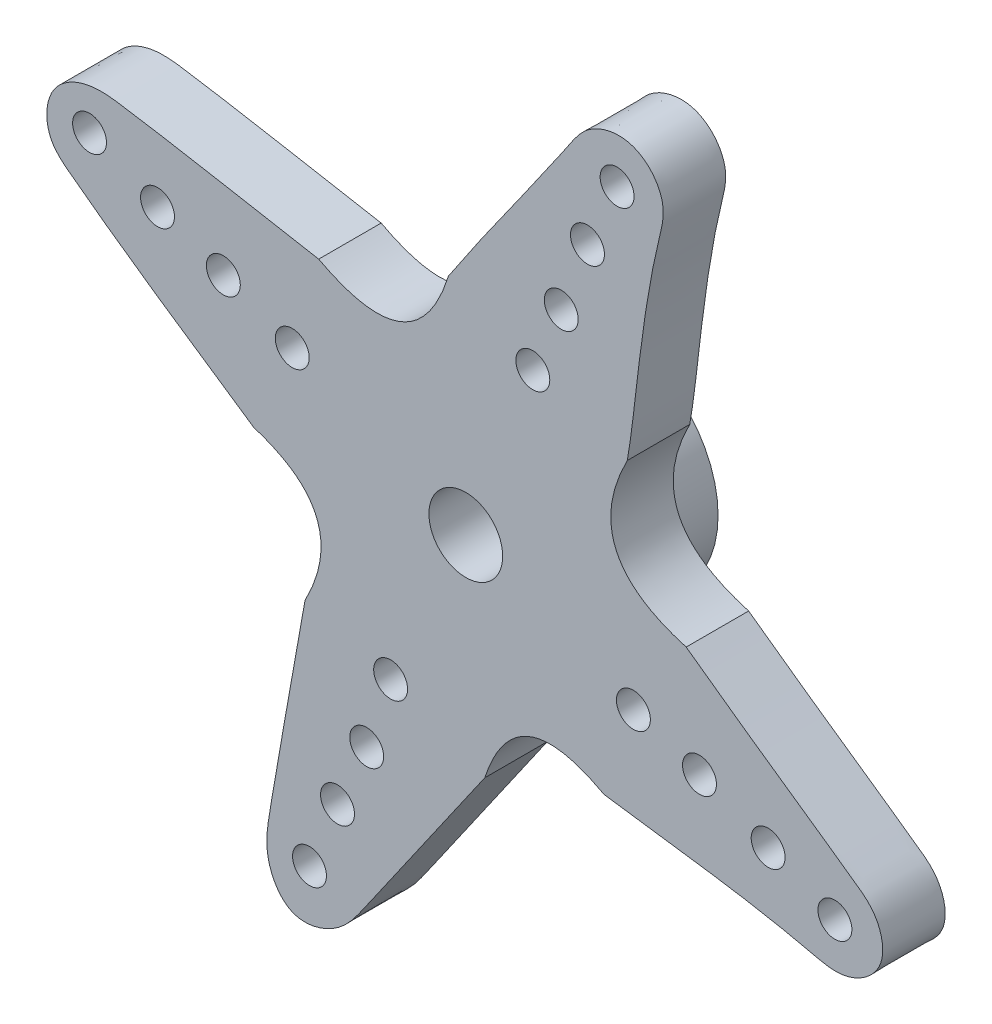
ISO-10303-21;
HEADER;
FILE_DESCRIPTION(('STEP AP214'),'2;1');
FILE_NAME('part.step','',(''),(''),'','','');
FILE_SCHEMA(('AUTOMOTIVE_DESIGN { 1 0 10303 214 1 1 1 1 }'));
ENDSEC;
DATA;
#1=APPLICATION_CONTEXT('core data for automotive mechanical design processes');
#2=APPLICATION_PROTOCOL_DEFINITION('international standard','automotive_design',2000,#1);
#3=PRODUCT_CONTEXT('',#1,'mechanical');
#4=PRODUCT('Part','Part','',(#3));
#5=PRODUCT_RELATED_PRODUCT_CATEGORY('part','',(#4));
#6=PRODUCT_DEFINITION_FORMATION('','',#4);
#7=PRODUCT_DEFINITION_CONTEXT('part definition',#1,'design');
#8=PRODUCT_DEFINITION('design','',#6,#7);
#9=PRODUCT_DEFINITION_SHAPE('','',#8);
#10=(LENGTH_UNIT() NAMED_UNIT(*) SI_UNIT(.MILLI.,.METRE.));
#11=(NAMED_UNIT(*) PLANE_ANGLE_UNIT() SI_UNIT($,.RADIAN.));
#12=(NAMED_UNIT(*) SI_UNIT($,.STERADIAN.) SOLID_ANGLE_UNIT());
#13=UNCERTAINTY_MEASURE_WITH_UNIT(LENGTH_MEASURE(1.E-05),#10,'distance_accuracy_value','');
#14=(GEOMETRIC_REPRESENTATION_CONTEXT(3) GLOBAL_UNCERTAINTY_ASSIGNED_CONTEXT((#13)) GLOBAL_UNIT_ASSIGNED_CONTEXT((#10,
#11,#12)) REPRESENTATION_CONTEXT('',''));
#15=CARTESIAN_POINT('',(0.,0.,0.));
#16=DIRECTION('',(0.,0.,1.));
#17=DIRECTION('',(1.,0.,0.));
#18=AXIS2_PLACEMENT_3D('',#15,#16,#17);
#19=CARTESIAN_POINT('',(6.82853944152075,17.0743412386927,2.54));
#20=DIRECTION('',(0.,0.,1.));
#21=DIRECTION('',(1.,0.,0.));
#22=AXIS2_PLACEMENT_3D('',#19,#20,#21);
#23=PLANE('',#22);
#24=CARTESIAN_POINT('',(15.0110323014964,-6.04474796311474,2.54));
#25=DIRECTION('',(0.,0.,1.));
#26=DIRECTION('',(1.,0.,0.));
#27=AXIS2_PLACEMENT_3D('',#24,#25,#26);
#28=CIRCLE('',#27,0.689564765000003);
#29=CARTESIAN_POINT('',(15.7005970664964,-6.04474796311474,2.54));
#30=VERTEX_POINT('',#29);
#31=EDGE_CURVE('E1509',#30,#30,#28,.T.);
#32=ORIENTED_EDGE('',*,*,#31,.F.);
#33=EDGE_LOOP('',(#32));
#34=FACE_BOUND('',#33,.T.);
#35=CARTESIAN_POINT('',(9.50380695056552,-3.69400279681072,2.54));
#36=DIRECTION('',(0.,0.,1.));
#37=DIRECTION('',(1.,0.,0.));
#38=AXIS2_PLACEMENT_3D('',#35,#36,#37);
#39=CIRCLE('',#38,0.689564765000001);
#40=CARTESIAN_POINT('',(10.1933717155655,-3.69400279681072,2.54));
#41=VERTEX_POINT('',#40);
#42=EDGE_CURVE('E1522',#41,#41,#39,.T.);
#43=ORIENTED_EDGE('',*,*,#42,.F.);
#44=EDGE_LOOP('',(#43));
#45=FACE_BOUND('',#44,.T.);
#46=CARTESIAN_POINT('',(6.15355173549287,15.3431479204628,2.54));
#47=DIRECTION('',(0.,0.,1.));
#48=DIRECTION('',(1.,0.,0.));
#49=AXIS2_PLACEMENT_3D('',#46,#47,#48);
#50=CIRCLE('',#49,0.689564764999999);
#51=CARTESIAN_POINT('',(6.84311650049287,15.3431479204628,2.54));
#52=VERTEX_POINT('',#51);
#53=EDGE_CURVE('E1530',#52,#52,#50,.T.);
#54=ORIENTED_EDGE('',*,*,#53,.F.);
#55=EDGE_LOOP('',(#54));
#56=FACE_BOUND('',#55,.T.);
#57=CARTESIAN_POINT('',(3.88207996758738,9.87307305081287,2.54));
#58=DIRECTION('',(0.,0.,1.));
#59=DIRECTION('',(1.,0.,0.));
#60=AXIS2_PLACEMENT_3D('',#57,#58,#59);
#61=CIRCLE('',#60,0.689564764999999);
#62=CARTESIAN_POINT('',(4.57164473258738,9.87307305081287,2.54));
#63=VERTEX_POINT('',#62);
#64=EDGE_CURVE('E1538',#63,#63,#61,.T.);
#65=ORIENTED_EDGE('',*,*,#64,.F.);
#66=EDGE_LOOP('',(#65));
#67=FACE_BOUND('',#66,.T.);
#68=CARTESIAN_POINT('',(-15.299960499322,6.51066111786951,2.54));
#69=DIRECTION('',(0.,0.,1.));
#70=DIRECTION('',(1.,0.,0.));
#71=AXIS2_PLACEMENT_3D('',#68,#69,#70);
#72=CIRCLE('',#71,0.689564765000001);
#73=CARTESIAN_POINT('',(-14.610395734322,6.51066111786951,2.54));
#74=VERTEX_POINT('',#73);
#75=EDGE_CURVE('E1546',#74,#74,#72,.T.);
#76=ORIENTED_EDGE('',*,*,#75,.F.);
#77=EDGE_LOOP('',(#76));
#78=FACE_BOUND('',#77,.T.);
#79=CARTESIAN_POINT('',(-9.85922555833631,4.21630227451655,2.54));
#80=DIRECTION('',(0.,0.,1.));
#81=DIRECTION('',(1.,0.,0.));
#82=AXIS2_PLACEMENT_3D('',#79,#80,#81);
#83=CIRCLE('',#82,0.689564765000001);
#84=CARTESIAN_POINT('',(-9.16966079333631,4.21630227451655,2.54));
#85=VERTEX_POINT('',#84);
#86=EDGE_CURVE('E1554',#85,#85,#83,.T.);
#87=ORIENTED_EDGE('',*,*,#86,.F.);
#88=EDGE_LOOP('',(#87));
#89=FACE_BOUND('',#88,.T.);
#90=CARTESIAN_POINT('',(-6.35515129323099,-14.8372029157483,2.54));
#91=DIRECTION('',(0.,0.,1.));
#92=DIRECTION('',(1.,0.,0.));
#93=AXIS2_PLACEMENT_3D('',#90,#91,#92);
#94=CIRCLE('',#93,0.689564764999999);
#95=CARTESIAN_POINT('',(-5.66558652823099,-14.8372029157483,2.54));
#96=VERTEX_POINT('',#95);
#97=EDGE_CURVE('E1562',#96,#96,#94,.T.);
#98=ORIENTED_EDGE('',*,*,#97,.F.);
#99=EDGE_LOOP('',(#98));
#100=FACE_BOUND('',#99,.T.);
#101=CARTESIAN_POINT('',(-4.02933004456876,-9.48240515720032,2.54));
#102=DIRECTION('',(0.,0.,1.));
#103=DIRECTION('',(1.,0.,0.));
#104=AXIS2_PLACEMENT_3D('',#101,#102,#103);
#105=CIRCLE('',#104,0.689564765);
#106=CARTESIAN_POINT('',(-3.33976527956876,-9.48240515720032,2.54));
#107=VERTEX_POINT('',#106);
#108=EDGE_CURVE('E1570',#107,#107,#105,.T.);
#109=ORIENTED_EDGE('',*,*,#108,.F.);
#110=EDGE_LOOP('',(#109));
#111=FACE_BOUND('',#110,.T.);
#112=CARTESIAN_POINT('',(-0.703210077517724,8.76805022749938,2.54));
#113=CARTESIAN_POINT('',(1.0381039908637,11.4145666756958,2.54));
#114=CARTESIAN_POINT('',(2.72632780891961,13.6001825715562,2.54));
#115=CARTESIAN_POINT('',(4.9857595076741,17.02869940722,2.54));
#116=CARTESIAN_POINT('',(6.94499629770619,17.4757430128905,2.54));
#117=CARTESIAN_POINT('',(8.24923979238083,15.8420364505879,2.54));
#118=CARTESIAN_POINT('',(7.12374128944502,11.6665294451666,2.54));
#119=CARTESIAN_POINT('',(6.91279609115673,7.79561059767481,2.54));
#120=CARTESIAN_POINT('',(6.56712149500294,5.90543390832021,2.54));
#121=B_SPLINE_CURVE_WITH_KNOTS('',3,(#112,#113,#114,#115,#116,#117,#118,#119,#120),
.UNSPECIFIED.,.F.,.F.,(4,1,1,1,1,1,4),(0.,0.368171065262444,0.418118471817799,0.499474065553551,
0.581227244319548,0.631279837764193,1.),.UNSPECIFIED.);
#122=CARTESIAN_POINT('',(-0.703210077517724,8.76805022749938,2.54));
#123=VERTEX_POINT('',#122);
#124=CARTESIAN_POINT('',(6.56712149500294,5.90543390832021,2.54));
#125=VERTEX_POINT('',#124);
#126=EDGE_CURVE('E1330',#123,#125,#121,.T.);
#127=ORIENTED_EDGE('',*,*,#126,.F.);
#128=CARTESIAN_POINT('',(-0.703210077517724,8.76805022749938,2.54));
#129=CARTESIAN_POINT('',(-2.00862770502038,4.60560126571447,2.54));
#130=CARTESIAN_POINT('',(-5.98058844150273,6.72376397762608,2.54));
#131=B_SPLINE_CURVE_WITH_KNOTS('',2,(#128,#129,#130),.UNSPECIFIED.,.F.,.F.,(3,3),(0.,1.),.UNSPECIFIED.);
#132=CARTESIAN_POINT('',(-5.98058844150273,6.72376397762608,2.54));
#133=VERTEX_POINT('',#132);
#134=EDGE_CURVE('E1274',#123,#133,#131,.T.);
#135=ORIENTED_EDGE('',*,*,#134,.T.);
#136=CARTESIAN_POINT('',(-8.62512041047836,-0.523225883449996,2.54));
#137=CARTESIAN_POINT('',(-12.0915100625833,1.82548059142509,2.54));
#138=CARTESIAN_POINT('',(-13.6556544540435,2.85197258646134,2.54));
#139=CARTESIAN_POINT('',(-17.1250188284723,5.4628982619902,2.54));
#140=CARTESIAN_POINT('',(-17.0830031073306,7.51790593543252,2.54));
#141=CARTESIAN_POINT('',(-15.3867381584555,8.3519591654845,2.54));
#142=CARTESIAN_POINT('',(-11.0921197480101,7.67928259894828,2.54));
#143=CARTESIAN_POINT('',(-8.69928178717215,7.19505935389887,2.54));
#144=CARTESIAN_POINT('',(-5.98058844150273,6.72376397762608,2.54));
#145=B_SPLINE_CURVE_WITH_KNOTS('',3,(#136,#137,#138,#139,#140,#141,#142,#143,#144),
.UNSPECIFIED.,.F.,.F.,(4,1,1,1,1,1,4),(0.,0.388587578903851,0.43995621972371,0.51368640819859,
0.605056424474045,0.653687783654186,1.),.UNSPECIFIED.);
#146=CARTESIAN_POINT('',(-8.62512041047836,-0.523225883449996,2.54));
#147=VERTEX_POINT('',#146);
#148=EDGE_CURVE('E1258',#147,#133,#145,.T.);
#149=ORIENTED_EDGE('',*,*,#148,.F.);
#150=CARTESIAN_POINT('',(-6.53821398719145,-5.57486786039796,2.54));
#151=CARTESIAN_POINT('',(-4.54840958840828,-1.79079774714659,2.54));
#152=CARTESIAN_POINT('',(-8.62512041047836,-0.523225883449996,2.54));
#153=B_SPLINE_CURVE_WITH_KNOTS('',2,(#150,#151,#152),.UNSPECIFIED.,.F.,.F.,(3,3),(0.,1.),.UNSPECIFIED.);
#154=CARTESIAN_POINT('',(-6.53821398719145,-5.57486786039796,2.54));
#155=VERTEX_POINT('',#154);
#156=EDGE_CURVE('E1272',#155,#147,#153,.T.);
#157=ORIENTED_EDGE('',*,*,#156,.F.);
#158=CARTESIAN_POINT('',(0.771597820303782,-8.16692335038116,2.54));
#159=CARTESIAN_POINT('',(-1.49853710820962,-11.4058595502788,2.54));
#160=CARTESIAN_POINT('',(-2.57211491436518,-12.9915947512976,2.54));
#161=CARTESIAN_POINT('',(-5.13486791395281,-16.6353923908952,2.54));
#162=CARTESIAN_POINT('',(-7.24838551555575,-17.3265199853754,2.54));
#163=CARTESIAN_POINT('',(-8.23457956530067,-15.3840753756716,2.54));
#164=CARTESIAN_POINT('',(-7.56070229322394,-11.154226455588,2.54));
#165=CARTESIAN_POINT('',(-7.16903812645431,-9.21402013025002,2.54));
#166=CARTESIAN_POINT('',(-6.53821398719145,-5.57486786039796,2.54));
#167=B_SPLINE_CURVE_WITH_KNOTS('',3,(#158,#159,#160,#161,#162,#163,#164,#165,#166),
.UNSPECIFIED.,.F.,.F.,(4,1,1,1,1,1,4),(0.,0.370191431555256,0.421116933554674,0.509255019994183,
0.593777602652699,0.642852100653281,1.),.UNSPECIFIED.);
#168=CARTESIAN_POINT('',(0.771597820303782,-8.16692335038116,2.54));
#169=VERTEX_POINT('',#168);
#170=EDGE_CURVE('E1277',#169,#155,#167,.T.);
#171=ORIENTED_EDGE('',*,*,#170,.F.);
#172=CARTESIAN_POINT('',(5.62582924939647,-6.32934571457167,2.54));
#173=CARTESIAN_POINT('',(2.02488525383602,-4.34414970674427,2.54));
#174=CARTESIAN_POINT('',(0.771597820303782,-8.16692335038116,2.54));
#175=B_SPLINE_CURVE_WITH_KNOTS('',2,(#172,#173,#174),.UNSPECIFIED.,.F.,.F.,(3,3),(0.,1.),.UNSPECIFIED.);
#176=CARTESIAN_POINT('',(5.62582924939648,-6.32934571457167,2.54));
#177=VERTEX_POINT('',#176);
#178=EDGE_CURVE('E1279',#177,#169,#175,.T.);
#179=ORIENTED_EDGE('',*,*,#178,.F.);
#180=CARTESIAN_POINT('',(8.96274233082295,0.533193532011644,2.54));
#181=CARTESIAN_POINT('',(11.2335991283414,-1.13517069281961,2.54));
#182=CARTESIAN_POINT('',(13.7942781422457,-2.87202571612899,2.54));
#183=CARTESIAN_POINT('',(16.8047429354932,-5.01994579791316,2.54));
#184=CARTESIAN_POINT('',(17.2404915702359,-6.87911123796634,2.54));
#185=CARTESIAN_POINT('',(15.5339693931067,-8.05394909749372,2.54));
#186=CARTESIAN_POINT('',(11.4592743341051,-7.03298302467717,2.54));
#187=CARTESIAN_POINT('',(8.25476221196085,-6.72908087602364,2.54));
#188=CARTESIAN_POINT('',(5.62582924939648,-6.32934571457167,2.54));
#189=B_SPLINE_CURVE_WITH_KNOTS('',3,(#180,#181,#182,#183,#184,#185,#186,#187,#188),
.UNSPECIFIED.,.F.,.F.,(4,1,1,1,1,1,4),(0.,0.365230701732073,0.413690238940785,0.484595372087122,
0.573039447977849,0.624579910769137,1.),.UNSPECIFIED.);
#190=CARTESIAN_POINT('',(8.96274233082295,0.533193532011644,2.54));
#191=VERTEX_POINT('',#190);
#192=EDGE_CURVE('E1314',#191,#177,#189,.T.);
#193=ORIENTED_EDGE('',*,*,#192,.F.);
#194=CARTESIAN_POINT('',(6.56712149500294,5.90543390832021,2.54));
#195=CARTESIAN_POINT('',(4.46183722621209,1.82812265370993,2.54));
#196=CARTESIAN_POINT('',(8.96274233082295,0.533193532011644,2.54));
#197=B_SPLINE_CURVE_WITH_KNOTS('',2,(#194,#195,#196),.UNSPECIFIED.,.F.,.F.,(3,3),(0.,1.),.UNSPECIFIED.);
#198=EDGE_CURVE('E1323',#125,#191,#197,.T.);
#199=ORIENTED_EDGE('',*,*,#198,.F.);
#200=EDGE_LOOP('',(#127,#135,#149,#157,#171,#179,#193,#199));
#201=FACE_BOUND('',#200,.T.);
#202=CARTESIAN_POINT('',(-3.0557304521055,-6.61569524605849,2.54));
#203=DIRECTION('',(0.,0.,1.));
#204=DIRECTION('',(1.,0.,0.));
#205=AXIS2_PLACEMENT_3D('',#202,#203,#204);
#206=CIRCLE('',#205,0.689564765);
#207=CARTESIAN_POINT('',(-2.3661656871055,-6.61569524605849,2.54));
#208=VERTEX_POINT('',#207);
#209=EDGE_CURVE('E1377',#208,#208,#206,.T.);
#210=ORIENTED_EDGE('',*,*,#209,.F.);
#211=EDGE_LOOP('',(#210));
#212=FACE_BOUND('',#211,.T.);
#213=CARTESIAN_POINT('',(-5.21566181728778,-12.0968387971859,2.54));
#214=DIRECTION('',(0.,0.,1.));
#215=DIRECTION('',(1.,0.,0.));
#216=AXIS2_PLACEMENT_3D('',#213,#214,#215);
#217=CIRCLE('',#216,0.689564764999999);
#218=CARTESIAN_POINT('',(-4.52609705228778,-12.0968387971859,2.54));
#219=VERTEX_POINT('',#218);
#220=EDGE_CURVE('E1566',#219,#219,#217,.T.);
#221=ORIENTED_EDGE('',*,*,#220,.F.);
#222=EDGE_LOOP('',(#221));
#223=FACE_BOUND('',#222,.T.);
#224=CARTESIAN_POINT('',(-7.05736950340857,3.05548821757024,2.54));
#225=DIRECTION('',(0.,0.,1.));
#226=DIRECTION('',(1.,0.,0.));
#227=AXIS2_PLACEMENT_3D('',#224,#225,#226);
#228=CIRCLE('',#227,0.689564765);
#229=CARTESIAN_POINT('',(-6.36780473840857,3.05548821757024,2.54));
#230=VERTEX_POINT('',#229);
#231=EDGE_CURVE('E1558',#230,#230,#228,.T.);
#232=ORIENTED_EDGE('',*,*,#231,.F.);
#233=EDGE_LOOP('',(#232));
#234=FACE_BOUND('',#233,.T.);
#235=CARTESIAN_POINT('',(-12.5357673533425,5.2796348965279,2.54));
#236=DIRECTION('',(0.,0.,1.));
#237=DIRECTION('',(1.,0.,0.));
#238=AXIS2_PLACEMENT_3D('',#235,#236,#237);
#239=CIRCLE('',#238,0.689564765000001);
#240=CARTESIAN_POINT('',(-11.8462025883425,5.2796348965279,2.54));
#241=VERTEX_POINT('',#240);
#242=EDGE_CURVE('E1550',#241,#241,#239,.T.);
#243=ORIENTED_EDGE('',*,*,#242,.F.);
#244=EDGE_LOOP('',(#243));
#245=FACE_BOUND('',#244,.T.);
#246=CARTESIAN_POINT('',(2.72588564575067,7.16635513995998,2.54));
#247=DIRECTION('',(0.,0.,1.));
#248=DIRECTION('',(1.,0.,0.));
#249=AXIS2_PLACEMENT_3D('',#246,#247,#248);
#250=CIRCLE('',#249,0.689564765);
#251=CARTESIAN_POINT('',(3.41545041075067,7.16635513995998,2.54));
#252=VERTEX_POINT('',#251);
#253=EDGE_CURVE('E1542',#252,#252,#250,.T.);
#254=ORIENTED_EDGE('',*,*,#253,.F.);
#255=EDGE_LOOP('',(#254));
#256=FACE_BOUND('',#255,.T.);
#257=CARTESIAN_POINT('',(4.9482810015022,12.7008236190217,2.54));
#258=DIRECTION('',(0.,0.,1.));
#259=DIRECTION('',(1.,0.,0.));
#260=AXIS2_PLACEMENT_3D('',#257,#258,#259);
#261=CIRCLE('',#260,0.689564764999999);
#262=CARTESIAN_POINT('',(5.6378457665022,12.7008236190217,2.54));
#263=VERTEX_POINT('',#262);
#264=EDGE_CURVE('E1534',#263,#263,#261,.T.);
#265=ORIENTED_EDGE('',*,*,#264,.F.);
#266=EDGE_LOOP('',(#265));
#267=FACE_BOUND('',#266,.T.);
#268=CARTESIAN_POINT('',(6.81646766958087,-2.7503902020745,2.54));
#269=DIRECTION('',(0.,0.,1.));
#270=DIRECTION('',(1.,0.,0.));
#271=AXIS2_PLACEMENT_3D('',#268,#269,#270);
#272=CIRCLE('',#271,0.689564764999999);
#273=CARTESIAN_POINT('',(7.50603243458087,-2.7503902020745,2.54));
#274=VERTEX_POINT('',#273);
#275=EDGE_CURVE('E1526',#274,#274,#272,.T.);
#276=ORIENTED_EDGE('',*,*,#275,.F.);
#277=EDGE_LOOP('',(#276));
#278=FACE_BOUND('',#277,.T.);
#279=CARTESIAN_POINT('',(12.2964211639447,-4.86785831252254,2.54));
#280=DIRECTION('',(0.,0.,1.));
#281=DIRECTION('',(1.,0.,0.));
#282=AXIS2_PLACEMENT_3D('',#279,#280,#281);
#283=CIRCLE('',#282,0.689564765000001);
#284=CARTESIAN_POINT('',(12.9859859289447,-4.86785831252254,2.54));
#285=VERTEX_POINT('',#284);
#286=EDGE_CURVE('E1518',#285,#285,#283,.T.);
#287=ORIENTED_EDGE('',*,*,#286,.F.);
#288=EDGE_LOOP('',(#287));
#289=FACE_BOUND('',#288,.T.);
#290=CARTESIAN_POINT('',(0.,0.,2.54));
#291=DIRECTION('',(0.,0.,1.));
#292=DIRECTION('',(1.,0.,0.));
#293=AXIS2_PLACEMENT_3D('',#290,#291,#292);
#294=CIRCLE('',#293,1.5);
#295=CARTESIAN_POINT('',(1.5,0.,2.54));
#296=VERTEX_POINT('',#295);
#297=EDGE_CURVE('E1510',#296,#296,#294,.T.);
#298=ORIENTED_EDGE('',*,*,#297,.F.);
#299=EDGE_LOOP('',(#298));
#300=FACE_BOUND('',#299,.T.);
#301=ADVANCED_FACE('F1184',(#34,#45,#56,#67,#78,#89,#100,#111,#201,#212,#223,#234,#245,#256,
#267,#278,#289,#300),#23,.T.);
#302=CARTESIAN_POINT('',(6.82853944152075,17.0743412386927,0.));
#303=DIRECTION('',(0.,0.,1.));
#304=DIRECTION('',(1.,0.,0.));
#305=AXIS2_PLACEMENT_3D('',#302,#303,#304);
#306=PLANE('',#305);
#307=CARTESIAN_POINT('',(0.,0.,0.));
#308=DIRECTION('',(0.,0.,1.));
#309=DIRECTION('',(1.,0.,0.));
#310=AXIS2_PLACEMENT_3D('',#307,#308,#309);
#311=CIRCLE('',#310,4.44);
#312=CARTESIAN_POINT('',(4.44,0.,0.));
#313=VERTEX_POINT('',#312);
#314=EDGE_CURVE('E1604',#313,#313,#311,.T.);
#315=ORIENTED_EDGE('',*,*,#314,.T.);
#316=EDGE_LOOP('',(#315));
#317=FACE_BOUND('',#316,.T.);
#318=CARTESIAN_POINT('',(-0.703210077517724,8.76805022749938,0.));
#319=CARTESIAN_POINT('',(1.0381039908637,11.4145666756958,0.));
#320=CARTESIAN_POINT('',(2.72632780891961,13.6001825715562,0.));
#321=CARTESIAN_POINT('',(4.9857595076741,17.02869940722,0.));
#322=CARTESIAN_POINT('',(6.94499629770619,17.4757430128905,0.));
#323=CARTESIAN_POINT('',(8.24923979238083,15.8420364505879,0.));
#324=CARTESIAN_POINT('',(7.12374128944502,11.6665294451666,0.));
#325=CARTESIAN_POINT('',(6.91279609115673,7.79561059767481,0.));
#326=CARTESIAN_POINT('',(6.56712149500294,5.90543390832021,0.));
#327=B_SPLINE_CURVE_WITH_KNOTS('',3,(#318,#319,#320,#321,#322,#323,#324,#325,#326),
.UNSPECIFIED.,.F.,.F.,(4,1,1,1,1,1,4),(0.,0.368171065262444,0.418118471817799,0.499474065553551,
0.581227244319548,0.631279837764193,1.),.UNSPECIFIED.);
#328=CARTESIAN_POINT('',(-0.703210077517724,8.76805022749938,0.));
#329=VERTEX_POINT('',#328);
#330=CARTESIAN_POINT('',(6.56712149500294,5.90543390832021,0.));
#331=VERTEX_POINT('',#330);
#332=EDGE_CURVE('E1368',#329,#331,#327,.T.);
#333=ORIENTED_EDGE('',*,*,#332,.T.);
#334=CARTESIAN_POINT('',(6.56712149500294,5.90543390832021,0.));
#335=CARTESIAN_POINT('',(4.46183722621209,1.82812265370993,0.));
#336=CARTESIAN_POINT('',(8.96274233082295,0.533193532011644,0.));
#337=B_SPLINE_CURVE_WITH_KNOTS('',2,(#334,#335,#336),.UNSPECIFIED.,.F.,.F.,(3,3),(0.,1.),.UNSPECIFIED.);
#338=CARTESIAN_POINT('',(8.96274233082295,0.533193532011644,0.));
#339=VERTEX_POINT('',#338);
#340=EDGE_CURVE('E1376',#331,#339,#337,.T.);
#341=ORIENTED_EDGE('',*,*,#340,.T.);
#342=CARTESIAN_POINT('',(8.96274233082295,0.533193532011644,0.));
#343=CARTESIAN_POINT('',(11.2335991283414,-1.13517069281961,0.));
#344=CARTESIAN_POINT('',(13.7942781422457,-2.87202571612899,0.));
#345=CARTESIAN_POINT('',(16.8047429354932,-5.01994579791316,0.));
#346=CARTESIAN_POINT('',(17.2404915702359,-6.87911123796634,0.));
#347=CARTESIAN_POINT('',(15.5339693931067,-8.05394909749372,0.));
#348=CARTESIAN_POINT('',(11.4592743341051,-7.03298302467717,0.));
#349=CARTESIAN_POINT('',(8.25476221196085,-6.72908087602364,0.));
#350=CARTESIAN_POINT('',(5.62582924939648,-6.32934571457167,0.));
#351=B_SPLINE_CURVE_WITH_KNOTS('',3,(#342,#343,#344,#345,#346,#347,#348,#349,#350),
.UNSPECIFIED.,.F.,.F.,(4,1,1,1,1,1,4),(0.,0.365230701732073,0.413690238940785,0.484595372087122,
0.573039447977849,0.624579910769137,1.),.UNSPECIFIED.);
#352=CARTESIAN_POINT('',(5.62582924939648,-6.32934571457167,0.));
#353=VERTEX_POINT('',#352);
#354=EDGE_CURVE('E1385',#339,#353,#351,.T.);
#355=ORIENTED_EDGE('',*,*,#354,.T.);
#356=CARTESIAN_POINT('',(5.62582924939647,-6.32934571457167,0.));
#357=CARTESIAN_POINT('',(2.02488525383602,-4.34414970674427,0.));
#358=CARTESIAN_POINT('',(0.771597820303782,-8.16692335038116,0.));
#359=B_SPLINE_CURVE_WITH_KNOTS('',2,(#356,#357,#358),.UNSPECIFIED.,.F.,.F.,(3,3),(0.,1.),.UNSPECIFIED.);
#360=CARTESIAN_POINT('',(0.771597820303782,-8.16692335038116,0.));
#361=VERTEX_POINT('',#360);
#362=EDGE_CURVE('E1393',#353,#361,#359,.T.);
#363=ORIENTED_EDGE('',*,*,#362,.T.);
#364=CARTESIAN_POINT('',(0.771597820303782,-8.16692335038116,0.));
#365=CARTESIAN_POINT('',(-1.49853710820962,-11.4058595502788,0.));
#366=CARTESIAN_POINT('',(-2.57211491436518,-12.9915947512976,0.));
#367=CARTESIAN_POINT('',(-5.13486791395281,-16.6353923908952,0.));
#368=CARTESIAN_POINT('',(-7.24838551555575,-17.3265199853754,0.));
#369=CARTESIAN_POINT('',(-8.23457956530067,-15.3840753756716,0.));
#370=CARTESIAN_POINT('',(-7.56070229322394,-11.154226455588,0.));
#371=CARTESIAN_POINT('',(-7.16903812645431,-9.21402013025002,0.));
#372=CARTESIAN_POINT('',(-6.53821398719145,-5.57486786039796,0.));
#373=B_SPLINE_CURVE_WITH_KNOTS('',3,(#364,#365,#366,#367,#368,#369,#370,#371,#372),
.UNSPECIFIED.,.F.,.F.,(4,1,1,1,1,1,4),(0.,0.370191431555256,0.421116933554674,0.509255019994183,
0.593777602652699,0.642852100653281,1.),.UNSPECIFIED.);
#374=CARTESIAN_POINT('',(-6.53821398719145,-5.57486786039796,0.));
#375=VERTEX_POINT('',#374);
#376=EDGE_CURVE('E1401',#361,#375,#373,.T.);
#377=ORIENTED_EDGE('',*,*,#376,.T.);
#378=CARTESIAN_POINT('',(-6.53821398719145,-5.57486786039796,0.));
#379=CARTESIAN_POINT('',(-4.54840958840828,-1.79079774714659,0.));
#380=CARTESIAN_POINT('',(-8.62512041047836,-0.523225883449996,0.));
#381=B_SPLINE_CURVE_WITH_KNOTS('',2,(#378,#379,#380),.UNSPECIFIED.,.F.,.F.,(3,3),(0.,1.),.UNSPECIFIED.);
#382=CARTESIAN_POINT('',(-8.62512041047836,-0.523225883449996,0.));
#383=VERTEX_POINT('',#382);
#384=EDGE_CURVE('E1409',#375,#383,#381,.T.);
#385=ORIENTED_EDGE('',*,*,#384,.T.);
#386=CARTESIAN_POINT('',(-8.62512041047836,-0.523225883449996,0.));
#387=CARTESIAN_POINT('',(-12.0915100625833,1.82548059142509,0.));
#388=CARTESIAN_POINT('',(-13.6556544540435,2.85197258646134,0.));
#389=CARTESIAN_POINT('',(-17.1250188284723,5.4628982619902,0.));
#390=CARTESIAN_POINT('',(-17.0830031073306,7.51790593543252,0.));
#391=CARTESIAN_POINT('',(-15.3867381584555,8.3519591654845,0.));
#392=CARTESIAN_POINT('',(-11.0921197480101,7.67928259894828,0.));
#393=CARTESIAN_POINT('',(-8.69928178717215,7.19505935389887,0.));
#394=CARTESIAN_POINT('',(-5.98058844150273,6.72376397762608,0.));
#395=B_SPLINE_CURVE_WITH_KNOTS('',3,(#386,#387,#388,#389,#390,#391,#392,#393,#394),
.UNSPECIFIED.,.F.,.F.,(4,1,1,1,1,1,4),(0.,0.388587578903851,0.43995621972371,0.51368640819859,
0.605056424474045,0.653687783654186,1.),.UNSPECIFIED.);
#396=CARTESIAN_POINT('',(-5.98058844150273,6.72376397762608,0.));
#397=VERTEX_POINT('',#396);
#398=EDGE_CURVE('E1260',#383,#397,#395,.T.);
#399=ORIENTED_EDGE('',*,*,#398,.T.);
#400=CARTESIAN_POINT('',(-0.703210077517724,8.76805022749938,0.));
#401=CARTESIAN_POINT('',(-2.00862770502038,4.60560126571447,0.));
#402=CARTESIAN_POINT('',(-5.98058844150273,6.72376397762608,0.));
#403=B_SPLINE_CURVE_WITH_KNOTS('',2,(#400,#401,#402),.UNSPECIFIED.,.F.,.F.,(3,3),(0.,1.),.UNSPECIFIED.);
#404=EDGE_CURVE('E1422',#329,#397,#403,.T.);
#405=ORIENTED_EDGE('',*,*,#404,.F.);
#406=EDGE_LOOP('',(#333,#341,#355,#363,#377,#385,#399,#405));
#407=FACE_BOUND('',#406,.T.);
#408=CARTESIAN_POINT('',(-3.0557304521055,-6.61569524605849,0.));
#409=DIRECTION('',(0.,0.,1.));
#410=DIRECTION('',(1.,0.,0.));
#411=AXIS2_PLACEMENT_3D('',#408,#409,#410);
#412=CIRCLE('',#411,0.689564765);
#413=CARTESIAN_POINT('',(-2.3661656871055,-6.61569524605849,0.));
#414=VERTEX_POINT('',#413);
#415=EDGE_CURVE('E1448',#414,#414,#412,.T.);
#416=ORIENTED_EDGE('',*,*,#415,.T.);
#417=EDGE_LOOP('',(#416));
#418=FACE_BOUND('',#417,.T.);
#419=CARTESIAN_POINT('',(-4.02933004456876,-9.48240515720032,0.));
#420=DIRECTION('',(0.,0.,1.));
#421=DIRECTION('',(1.,0.,0.));
#422=AXIS2_PLACEMENT_3D('',#419,#420,#421);
#423=CIRCLE('',#422,0.689564765);
#424=CARTESIAN_POINT('',(-3.33976527956876,-9.48240515720032,0.));
#425=VERTEX_POINT('',#424);
#426=EDGE_CURVE('E1452',#425,#425,#423,.T.);
#427=ORIENTED_EDGE('',*,*,#426,.T.);
#428=EDGE_LOOP('',(#427));
#429=FACE_BOUND('',#428,.T.);
#430=CARTESIAN_POINT('',(-5.21566181728778,-12.0968387971859,0.));
#431=DIRECTION('',(0.,0.,1.));
#432=DIRECTION('',(1.,0.,0.));
#433=AXIS2_PLACEMENT_3D('',#430,#431,#432);
#434=CIRCLE('',#433,0.689564764999999);
#435=CARTESIAN_POINT('',(-4.52609705228778,-12.0968387971859,0.));
#436=VERTEX_POINT('',#435);
#437=EDGE_CURVE('E1456',#436,#436,#434,.T.);
#438=ORIENTED_EDGE('',*,*,#437,.T.);
#439=EDGE_LOOP('',(#438));
#440=FACE_BOUND('',#439,.T.);
#441=CARTESIAN_POINT('',(-6.35515129323099,-14.8372029157483,0.));
#442=DIRECTION('',(0.,0.,1.));
#443=DIRECTION('',(1.,0.,0.));
#444=AXIS2_PLACEMENT_3D('',#441,#442,#443);
#445=CIRCLE('',#444,0.689564764999999);
#446=CARTESIAN_POINT('',(-5.66558652823099,-14.8372029157483,0.));
#447=VERTEX_POINT('',#446);
#448=EDGE_CURVE('E1460',#447,#447,#445,.T.);
#449=ORIENTED_EDGE('',*,*,#448,.T.);
#450=EDGE_LOOP('',(#449));
#451=FACE_BOUND('',#450,.T.);
#452=CARTESIAN_POINT('',(-7.05736950340857,3.05548821757024,0.));
#453=DIRECTION('',(0.,0.,1.));
#454=DIRECTION('',(1.,0.,0.));
#455=AXIS2_PLACEMENT_3D('',#452,#453,#454);
#456=CIRCLE('',#455,0.689564765);
#457=CARTESIAN_POINT('',(-6.36780473840857,3.05548821757024,0.));
#458=VERTEX_POINT('',#457);
#459=EDGE_CURVE('E1464',#458,#458,#456,.T.);
#460=ORIENTED_EDGE('',*,*,#459,.T.);
#461=EDGE_LOOP('',(#460));
#462=FACE_BOUND('',#461,.T.);
#463=CARTESIAN_POINT('',(-9.85922555833631,4.21630227451655,0.));
#464=DIRECTION('',(0.,0.,1.));
#465=DIRECTION('',(1.,0.,0.));
#466=AXIS2_PLACEMENT_3D('',#463,#464,#465);
#467=CIRCLE('',#466,0.689564765000001);
#468=CARTESIAN_POINT('',(-9.16966079333631,4.21630227451655,0.));
#469=VERTEX_POINT('',#468);
#470=EDGE_CURVE('E1468',#469,#469,#467,.T.);
#471=ORIENTED_EDGE('',*,*,#470,.T.);
#472=EDGE_LOOP('',(#471));
#473=FACE_BOUND('',#472,.T.);
#474=CARTESIAN_POINT('',(-12.5357673533425,5.2796348965279,0.));
#475=DIRECTION('',(0.,0.,1.));
#476=DIRECTION('',(1.,0.,0.));
#477=AXIS2_PLACEMENT_3D('',#474,#475,#476);
#478=CIRCLE('',#477,0.689564765000001);
#479=CARTESIAN_POINT('',(-11.8462025883425,5.2796348965279,0.));
#480=VERTEX_POINT('',#479);
#481=EDGE_CURVE('E1472',#480,#480,#478,.T.);
#482=ORIENTED_EDGE('',*,*,#481,.T.);
#483=EDGE_LOOP('',(#482));
#484=FACE_BOUND('',#483,.T.);
#485=CARTESIAN_POINT('',(-15.299960499322,6.51066111786951,0.));
#486=DIRECTION('',(0.,0.,1.));
#487=DIRECTION('',(1.,0.,0.));
#488=AXIS2_PLACEMENT_3D('',#485,#486,#487);
#489=CIRCLE('',#488,0.689564765000001);
#490=CARTESIAN_POINT('',(-14.610395734322,6.51066111786951,0.));
#491=VERTEX_POINT('',#490);
#492=EDGE_CURVE('E1476',#491,#491,#489,.T.);
#493=ORIENTED_EDGE('',*,*,#492,.T.);
#494=EDGE_LOOP('',(#493));
#495=FACE_BOUND('',#494,.T.);
#496=CARTESIAN_POINT('',(2.72588564575067,7.16635513995998,0.));
#497=DIRECTION('',(0.,0.,1.));
#498=DIRECTION('',(1.,0.,0.));
#499=AXIS2_PLACEMENT_3D('',#496,#497,#498);
#500=CIRCLE('',#499,0.689564765);
#501=CARTESIAN_POINT('',(3.41545041075067,7.16635513995998,0.));
#502=VERTEX_POINT('',#501);
#503=EDGE_CURVE('E1480',#502,#502,#500,.T.);
#504=ORIENTED_EDGE('',*,*,#503,.T.);
#505=EDGE_LOOP('',(#504));
#506=FACE_BOUND('',#505,.T.);
#507=CARTESIAN_POINT('',(3.88207996758738,9.87307305081287,0.));
#508=DIRECTION('',(0.,0.,1.));
#509=DIRECTION('',(1.,0.,0.));
#510=AXIS2_PLACEMENT_3D('',#507,#508,#509);
#511=CIRCLE('',#510,0.689564764999999);
#512=CARTESIAN_POINT('',(4.57164473258738,9.87307305081287,0.));
#513=VERTEX_POINT('',#512);
#514=EDGE_CURVE('E1484',#513,#513,#511,.T.);
#515=ORIENTED_EDGE('',*,*,#514,.T.);
#516=EDGE_LOOP('',(#515));
#517=FACE_BOUND('',#516,.T.);
#518=CARTESIAN_POINT('',(4.9482810015022,12.7008236190217,0.));
#519=DIRECTION('',(0.,0.,1.));
#520=DIRECTION('',(1.,0.,0.));
#521=AXIS2_PLACEMENT_3D('',#518,#519,#520);
#522=CIRCLE('',#521,0.689564764999999);
#523=CARTESIAN_POINT('',(5.6378457665022,12.7008236190217,0.));
#524=VERTEX_POINT('',#523);
#525=EDGE_CURVE('E1488',#524,#524,#522,.T.);
#526=ORIENTED_EDGE('',*,*,#525,.T.);
#527=EDGE_LOOP('',(#526));
#528=FACE_BOUND('',#527,.T.);
#529=CARTESIAN_POINT('',(6.15355173549287,15.3431479204628,0.));
#530=DIRECTION('',(0.,0.,1.));
#531=DIRECTION('',(1.,0.,0.));
#532=AXIS2_PLACEMENT_3D('',#529,#530,#531);
#533=CIRCLE('',#532,0.689564764999999);
#534=CARTESIAN_POINT('',(6.84311650049287,15.3431479204628,0.));
#535=VERTEX_POINT('',#534);
#536=EDGE_CURVE('E1492',#535,#535,#533,.T.);
#537=ORIENTED_EDGE('',*,*,#536,.T.);
#538=EDGE_LOOP('',(#537));
#539=FACE_BOUND('',#538,.T.);
#540=CARTESIAN_POINT('',(6.81646766958087,-2.7503902020745,0.));
#541=DIRECTION('',(0.,0.,1.));
#542=DIRECTION('',(1.,0.,0.));
#543=AXIS2_PLACEMENT_3D('',#540,#541,#542);
#544=CIRCLE('',#543,0.689564764999999);
#545=CARTESIAN_POINT('',(7.50603243458087,-2.7503902020745,0.));
#546=VERTEX_POINT('',#545);
#547=EDGE_CURVE('E1496',#546,#546,#544,.T.);
#548=ORIENTED_EDGE('',*,*,#547,.T.);
#549=EDGE_LOOP('',(#548));
#550=FACE_BOUND('',#549,.T.);
#551=CARTESIAN_POINT('',(9.50380695056552,-3.69400279681072,0.));
#552=DIRECTION('',(0.,0.,1.));
#553=DIRECTION('',(1.,0.,0.));
#554=AXIS2_PLACEMENT_3D('',#551,#552,#553);
#555=CIRCLE('',#554,0.689564765000001);
#556=CARTESIAN_POINT('',(10.1933717155655,-3.69400279681072,0.));
#557=VERTEX_POINT('',#556);
#558=EDGE_CURVE('E1500',#557,#557,#555,.T.);
#559=ORIENTED_EDGE('',*,*,#558,.T.);
#560=EDGE_LOOP('',(#559));
#561=FACE_BOUND('',#560,.T.);
#562=CARTESIAN_POINT('',(12.2964211639447,-4.86785831252254,0.));
#563=DIRECTION('',(0.,0.,1.));
#564=DIRECTION('',(1.,0.,0.));
#565=AXIS2_PLACEMENT_3D('',#562,#563,#564);
#566=CIRCLE('',#565,0.689564765000001);
#567=CARTESIAN_POINT('',(12.9859859289447,-4.86785831252254,0.));
#568=VERTEX_POINT('',#567);
#569=EDGE_CURVE('E1504',#568,#568,#566,.T.);
#570=ORIENTED_EDGE('',*,*,#569,.T.);
#571=EDGE_LOOP('',(#570));
#572=FACE_BOUND('',#571,.T.);
#573=CARTESIAN_POINT('',(15.0110323014964,-6.04474796311474,0.));
#574=DIRECTION('',(0.,0.,1.));
#575=DIRECTION('',(1.,0.,0.));
#576=AXIS2_PLACEMENT_3D('',#573,#574,#575);
#577=CIRCLE('',#576,0.689564765000003);
#578=CARTESIAN_POINT('',(15.7005970664964,-6.04474796311474,0.));
#579=VERTEX_POINT('',#578);
#580=EDGE_CURVE('E1507',#579,#579,#577,.T.);
#581=ORIENTED_EDGE('',*,*,#580,.T.);
#582=EDGE_LOOP('',(#581));
#583=FACE_BOUND('',#582,.T.);
#584=ADVANCED_FACE('F1350',(#317,#407,#418,#429,#440,#451,#462,#473,#484,#495,#506,#517,#528,
#539,#550,#561,#572,#583),#306,.F.);
#585=DIRECTION('',(0.,0.,-1.));
#586=VECTOR('',#585,1.);
#587=SURFACE_OF_LINEAR_EXTRUSION('',#121,#586);
#588=ORIENTED_EDGE('',*,*,#332,.F.);
#589=DIRECTION('',(0.,0.,-1.));
#590=VECTOR('',#589,1.);
#591=CARTESIAN_POINT('',(-0.703210077517724,8.76805022749938,2.54));
#592=LINE('',#591,#590);
#593=EDGE_CURVE('E12',#123,#329,#592,.T.);
#594=ORIENTED_EDGE('',*,*,#593,.F.);
#595=ORIENTED_EDGE('',*,*,#126,.T.);
#596=DIRECTION('',(0.,0.,-1.));
#597=VECTOR('',#596,1.);
#598=CARTESIAN_POINT('',(6.56712149500294,5.90543390832021,2.54));
#599=LINE('',#598,#597);
#600=EDGE_CURVE('E1189',#125,#331,#599,.T.);
#601=ORIENTED_EDGE('',*,*,#600,.T.);
#602=EDGE_LOOP('',(#588,#594,#595,#601));
#603=FACE_BOUND('',#602,.T.);
#604=ADVANCED_FACE('F1186',(#603),#587,.T.);
#605=DIRECTION('',(0.,0.,-1.));
#606=VECTOR('',#605,1.);
#607=SURFACE_OF_LINEAR_EXTRUSION('',#131,#606);
#608=ORIENTED_EDGE('',*,*,#404,.T.);
#609=DIRECTION('',(0.,0.,-1.));
#610=VECTOR('',#609,1.);
#611=CARTESIAN_POINT('',(-5.98058844150273,6.72376397762608,2.54));
#612=LINE('',#611,#610);
#613=EDGE_CURVE('E1195',#133,#397,#612,.T.);
#614=ORIENTED_EDGE('',*,*,#613,.F.);
#615=ORIENTED_EDGE('',*,*,#134,.F.);
#616=ORIENTED_EDGE('',*,*,#593,.T.);
#617=EDGE_LOOP('',(#608,#614,#615,#616));
#618=FACE_BOUND('',#617,.T.);
#619=ADVANCED_FACE('F1362',(#618),#607,.F.);
#620=DIRECTION('',(0.,0.,-1.));
#621=VECTOR('',#620,1.);
#622=SURFACE_OF_LINEAR_EXTRUSION('',#145,#621);
#623=ORIENTED_EDGE('',*,*,#398,.F.);
#624=DIRECTION('',(0.,0.,-1.));
#625=VECTOR('',#624,1.);
#626=CARTESIAN_POINT('',(-8.62512041047836,-0.523225883449996,2.54));
#627=LINE('',#626,#625);
#628=EDGE_CURVE('E1255',#147,#383,#627,.T.);
#629=ORIENTED_EDGE('',*,*,#628,.F.);
#630=ORIENTED_EDGE('',*,*,#148,.T.);
#631=ORIENTED_EDGE('',*,*,#613,.T.);
#632=EDGE_LOOP('',(#623,#629,#630,#631));
#633=FACE_BOUND('',#632,.T.);
#634=ADVANCED_FACE('F1257',(#633),#622,.T.);
#635=DIRECTION('',(0.,0.,-1.));
#636=VECTOR('',#635,1.);
#637=SURFACE_OF_LINEAR_EXTRUSION('',#153,#636);
#638=ORIENTED_EDGE('',*,*,#384,.F.);
#639=DIRECTION('',(0.,0.,-1.));
#640=VECTOR('',#639,1.);
#641=CARTESIAN_POINT('',(-6.53821398719145,-5.57486786039796,2.54));
#642=LINE('',#641,#640);
#643=EDGE_CURVE('E1265',#155,#375,#642,.T.);
#644=ORIENTED_EDGE('',*,*,#643,.F.);
#645=ORIENTED_EDGE('',*,*,#156,.T.);
#646=ORIENTED_EDGE('',*,*,#628,.T.);
#647=EDGE_LOOP('',(#638,#644,#645,#646));
#648=FACE_BOUND('',#647,.T.);
#649=ADVANCED_FACE('F1276',(#648),#637,.T.);
#650=DIRECTION('',(0.,0.,-1.));
#651=VECTOR('',#650,1.);
#652=SURFACE_OF_LINEAR_EXTRUSION('',#167,#651);
#653=ORIENTED_EDGE('',*,*,#376,.F.);
#654=DIRECTION('',(0.,0.,-1.));
#655=VECTOR('',#654,1.);
#656=CARTESIAN_POINT('',(0.771597820303782,-8.16692335038116,2.54));
#657=LINE('',#656,#655);
#658=EDGE_CURVE('E1434',#169,#361,#657,.T.);
#659=ORIENTED_EDGE('',*,*,#658,.F.);
#660=ORIENTED_EDGE('',*,*,#170,.T.);
#661=ORIENTED_EDGE('',*,*,#643,.T.);
#662=EDGE_LOOP('',(#653,#659,#660,#661));
#663=FACE_BOUND('',#662,.T.);
#664=ADVANCED_FACE('F1299',(#663),#652,.T.);
#665=DIRECTION('',(0.,0.,-1.));
#666=VECTOR('',#665,1.);
#667=SURFACE_OF_LINEAR_EXTRUSION('',#175,#666);
#668=ORIENTED_EDGE('',*,*,#362,.F.);
#669=DIRECTION('',(0.,0.,-1.));
#670=VECTOR('',#669,1.);
#671=CARTESIAN_POINT('',(5.62582924939648,-6.32934571457167,2.54));
#672=LINE('',#671,#670);
#673=EDGE_CURVE('E1436',#177,#353,#672,.T.);
#674=ORIENTED_EDGE('',*,*,#673,.F.);
#675=ORIENTED_EDGE('',*,*,#178,.T.);
#676=ORIENTED_EDGE('',*,*,#658,.T.);
#677=EDGE_LOOP('',(#668,#674,#675,#676));
#678=FACE_BOUND('',#677,.T.);
#679=ADVANCED_FACE('F1303',(#678),#667,.T.);
#680=DIRECTION('',(0.,0.,-1.));
#681=VECTOR('',#680,1.);
#682=SURFACE_OF_LINEAR_EXTRUSION('',#189,#681);
#683=ORIENTED_EDGE('',*,*,#354,.F.);
#684=DIRECTION('',(0.,0.,-1.));
#685=VECTOR('',#684,1.);
#686=CARTESIAN_POINT('',(8.96274233082295,0.533193532011644,2.54));
#687=LINE('',#686,#685);
#688=EDGE_CURVE('E1437',#191,#339,#687,.T.);
#689=ORIENTED_EDGE('',*,*,#688,.F.);
#690=ORIENTED_EDGE('',*,*,#192,.T.);
#691=ORIENTED_EDGE('',*,*,#673,.T.);
#692=EDGE_LOOP('',(#683,#689,#690,#691));
#693=FACE_BOUND('',#692,.T.);
#694=ADVANCED_FACE('F1307',(#693),#682,.T.);
#695=DIRECTION('',(0.,0.,-1.));
#696=VECTOR('',#695,1.);
#697=SURFACE_OF_LINEAR_EXTRUSION('',#197,#696);
#698=ORIENTED_EDGE('',*,*,#340,.F.);
#699=ORIENTED_EDGE('',*,*,#600,.F.);
#700=ORIENTED_EDGE('',*,*,#198,.T.);
#701=ORIENTED_EDGE('',*,*,#688,.T.);
#702=EDGE_LOOP('',(#698,#699,#700,#701));
#703=FACE_BOUND('',#702,.T.);
#704=ADVANCED_FACE('F1338',(#703),#697,.T.);
#705=CARTESIAN_POINT('',(-3.0557304521055,-6.61569524605849,2.54));
#706=DIRECTION('',(0.,0.,-1.));
#707=DIRECTION('',(-1.,0.,0.));
#708=AXIS2_PLACEMENT_3D('',#705,#706,#707);
#709=CYLINDRICAL_SURFACE('',#708,0.689564765);
#710=ORIENTED_EDGE('',*,*,#209,.T.);
#711=EDGE_LOOP('',(#710));
#712=FACE_BOUND('',#711,.T.);
#713=ORIENTED_EDGE('',*,*,#415,.F.);
#714=EDGE_LOOP('',(#713));
#715=FACE_BOUND('',#714,.T.);
#716=ADVANCED_FACE('F1340',(#712,#715),#709,.F.);
#717=CARTESIAN_POINT('',(-4.02933004456876,-9.48240515720032,2.54));
#718=DIRECTION('',(0.,0.,-1.));
#719=DIRECTION('',(-1.,0.,0.));
#720=AXIS2_PLACEMENT_3D('',#717,#718,#719);
#721=CYLINDRICAL_SURFACE('',#720,0.689564765);
#722=ORIENTED_EDGE('',*,*,#108,.T.);
#723=EDGE_LOOP('',(#722));
#724=FACE_BOUND('',#723,.T.);
#725=ORIENTED_EDGE('',*,*,#426,.F.);
#726=EDGE_LOOP('',(#725));
#727=FACE_BOUND('',#726,.T.);
#728=ADVANCED_FACE('F1345',(#724,#727),#721,.F.);
#729=CARTESIAN_POINT('',(-5.21566181728778,-12.0968387971859,2.54));
#730=DIRECTION('',(0.,0.,-1.));
#731=DIRECTION('',(-1.,0.,0.));
#732=AXIS2_PLACEMENT_3D('',#729,#730,#731);
#733=CYLINDRICAL_SURFACE('',#732,0.689564764999999);
#734=ORIENTED_EDGE('',*,*,#220,.T.);
#735=EDGE_LOOP('',(#734));
#736=FACE_BOUND('',#735,.T.);
#737=ORIENTED_EDGE('',*,*,#437,.F.);
#738=EDGE_LOOP('',(#737));
#739=FACE_BOUND('',#738,.T.);
#740=ADVANCED_FACE('F1672',(#736,#739),#733,.F.);
#741=CARTESIAN_POINT('',(-6.35515129323099,-14.8372029157483,2.54));
#742=DIRECTION('',(0.,0.,-1.));
#743=DIRECTION('',(-1.,0.,0.));
#744=AXIS2_PLACEMENT_3D('',#741,#742,#743);
#745=CYLINDRICAL_SURFACE('',#744,0.689564764999999);
#746=ORIENTED_EDGE('',*,*,#97,.T.);
#747=EDGE_LOOP('',(#746));
#748=FACE_BOUND('',#747,.T.);
#749=ORIENTED_EDGE('',*,*,#448,.F.);
#750=EDGE_LOOP('',(#749));
#751=FACE_BOUND('',#750,.T.);
#752=ADVANCED_FACE('F1668',(#748,#751),#745,.F.);
#753=CARTESIAN_POINT('',(-7.05736950340857,3.05548821757024,2.54));
#754=DIRECTION('',(0.,0.,-1.));
#755=DIRECTION('',(-1.,0.,0.));
#756=AXIS2_PLACEMENT_3D('',#753,#754,#755);
#757=CYLINDRICAL_SURFACE('',#756,0.689564765);
#758=ORIENTED_EDGE('',*,*,#231,.T.);
#759=EDGE_LOOP('',(#758));
#760=FACE_BOUND('',#759,.T.);
#761=ORIENTED_EDGE('',*,*,#459,.F.);
#762=EDGE_LOOP('',(#761));
#763=FACE_BOUND('',#762,.T.);
#764=ADVANCED_FACE('F1664',(#760,#763),#757,.F.);
#765=CARTESIAN_POINT('',(-9.85922555833631,4.21630227451655,2.54));
#766=DIRECTION('',(0.,0.,-1.));
#767=DIRECTION('',(-1.,0.,0.));
#768=AXIS2_PLACEMENT_3D('',#765,#766,#767);
#769=CYLINDRICAL_SURFACE('',#768,0.689564765000001);
#770=ORIENTED_EDGE('',*,*,#86,.T.);
#771=EDGE_LOOP('',(#770));
#772=FACE_BOUND('',#771,.T.);
#773=ORIENTED_EDGE('',*,*,#470,.F.);
#774=EDGE_LOOP('',(#773));
#775=FACE_BOUND('',#774,.T.);
#776=ADVANCED_FACE('F1660',(#772,#775),#769,.F.);
#777=CARTESIAN_POINT('',(-12.5357673533425,5.2796348965279,2.54));
#778=DIRECTION('',(0.,0.,-1.));
#779=DIRECTION('',(-1.,0.,0.));
#780=AXIS2_PLACEMENT_3D('',#777,#778,#779);
#781=CYLINDRICAL_SURFACE('',#780,0.689564765000001);
#782=ORIENTED_EDGE('',*,*,#242,.T.);
#783=EDGE_LOOP('',(#782));
#784=FACE_BOUND('',#783,.T.);
#785=ORIENTED_EDGE('',*,*,#481,.F.);
#786=EDGE_LOOP('',(#785));
#787=FACE_BOUND('',#786,.T.);
#788=ADVANCED_FACE('F1656',(#784,#787),#781,.F.);
#789=CARTESIAN_POINT('',(-15.299960499322,6.51066111786951,2.54));
#790=DIRECTION('',(0.,0.,-1.));
#791=DIRECTION('',(-1.,0.,0.));
#792=AXIS2_PLACEMENT_3D('',#789,#790,#791);
#793=CYLINDRICAL_SURFACE('',#792,0.689564765000001);
#794=ORIENTED_EDGE('',*,*,#75,.T.);
#795=EDGE_LOOP('',(#794));
#796=FACE_BOUND('',#795,.T.);
#797=ORIENTED_EDGE('',*,*,#492,.F.);
#798=EDGE_LOOP('',(#797));
#799=FACE_BOUND('',#798,.T.);
#800=ADVANCED_FACE('F1652',(#796,#799),#793,.F.);
#801=CARTESIAN_POINT('',(2.72588564575067,7.16635513995998,2.54));
#802=DIRECTION('',(0.,0.,-1.));
#803=DIRECTION('',(-1.,0.,0.));
#804=AXIS2_PLACEMENT_3D('',#801,#802,#803);
#805=CYLINDRICAL_SURFACE('',#804,0.689564765);
#806=ORIENTED_EDGE('',*,*,#253,.T.);
#807=EDGE_LOOP('',(#806));
#808=FACE_BOUND('',#807,.T.);
#809=ORIENTED_EDGE('',*,*,#503,.F.);
#810=EDGE_LOOP('',(#809));
#811=FACE_BOUND('',#810,.T.);
#812=ADVANCED_FACE('F1648',(#808,#811),#805,.F.);
#813=CARTESIAN_POINT('',(3.88207996758738,9.87307305081287,2.54));
#814=DIRECTION('',(0.,0.,-1.));
#815=DIRECTION('',(-1.,0.,0.));
#816=AXIS2_PLACEMENT_3D('',#813,#814,#815);
#817=CYLINDRICAL_SURFACE('',#816,0.689564764999999);
#818=ORIENTED_EDGE('',*,*,#64,.T.);
#819=EDGE_LOOP('',(#818));
#820=FACE_BOUND('',#819,.T.);
#821=ORIENTED_EDGE('',*,*,#514,.F.);
#822=EDGE_LOOP('',(#821));
#823=FACE_BOUND('',#822,.T.);
#824=ADVANCED_FACE('F1644',(#820,#823),#817,.F.);
#825=CARTESIAN_POINT('',(4.9482810015022,12.7008236190217,2.54));
#826=DIRECTION('',(0.,0.,-1.));
#827=DIRECTION('',(-1.,0.,0.));
#828=AXIS2_PLACEMENT_3D('',#825,#826,#827);
#829=CYLINDRICAL_SURFACE('',#828,0.689564764999999);
#830=ORIENTED_EDGE('',*,*,#264,.T.);
#831=EDGE_LOOP('',(#830));
#832=FACE_BOUND('',#831,.T.);
#833=ORIENTED_EDGE('',*,*,#525,.F.);
#834=EDGE_LOOP('',(#833));
#835=FACE_BOUND('',#834,.T.);
#836=ADVANCED_FACE('F1640',(#832,#835),#829,.F.);
#837=CARTESIAN_POINT('',(6.15355173549287,15.3431479204628,2.54));
#838=DIRECTION('',(0.,0.,-1.));
#839=DIRECTION('',(-1.,0.,0.));
#840=AXIS2_PLACEMENT_3D('',#837,#838,#839);
#841=CYLINDRICAL_SURFACE('',#840,0.689564764999999);
#842=ORIENTED_EDGE('',*,*,#53,.T.);
#843=EDGE_LOOP('',(#842));
#844=FACE_BOUND('',#843,.T.);
#845=ORIENTED_EDGE('',*,*,#536,.F.);
#846=EDGE_LOOP('',(#845));
#847=FACE_BOUND('',#846,.T.);
#848=ADVANCED_FACE('F1636',(#844,#847),#841,.F.);
#849=CARTESIAN_POINT('',(6.81646766958087,-2.7503902020745,2.54));
#850=DIRECTION('',(0.,0.,-1.));
#851=DIRECTION('',(-1.,0.,0.));
#852=AXIS2_PLACEMENT_3D('',#849,#850,#851);
#853=CYLINDRICAL_SURFACE('',#852,0.689564764999999);
#854=ORIENTED_EDGE('',*,*,#275,.T.);
#855=EDGE_LOOP('',(#854));
#856=FACE_BOUND('',#855,.T.);
#857=ORIENTED_EDGE('',*,*,#547,.F.);
#858=EDGE_LOOP('',(#857));
#859=FACE_BOUND('',#858,.T.);
#860=ADVANCED_FACE('F1632',(#856,#859),#853,.F.);
#861=CARTESIAN_POINT('',(9.50380695056552,-3.69400279681072,2.54));
#862=DIRECTION('',(0.,0.,-1.));
#863=DIRECTION('',(-1.,0.,0.));
#864=AXIS2_PLACEMENT_3D('',#861,#862,#863);
#865=CYLINDRICAL_SURFACE('',#864,0.689564765000001);
#866=ORIENTED_EDGE('',*,*,#42,.T.);
#867=EDGE_LOOP('',(#866));
#868=FACE_BOUND('',#867,.T.);
#869=ORIENTED_EDGE('',*,*,#558,.F.);
#870=EDGE_LOOP('',(#869));
#871=FACE_BOUND('',#870,.T.);
#872=ADVANCED_FACE('F1628',(#868,#871),#865,.F.);
#873=CARTESIAN_POINT('',(12.2964211639447,-4.86785831252254,2.54));
#874=DIRECTION('',(0.,0.,-1.));
#875=DIRECTION('',(-1.,0.,0.));
#876=AXIS2_PLACEMENT_3D('',#873,#874,#875);
#877=CYLINDRICAL_SURFACE('',#876,0.689564765000001);
#878=ORIENTED_EDGE('',*,*,#286,.T.);
#879=EDGE_LOOP('',(#878));
#880=FACE_BOUND('',#879,.T.);
#881=ORIENTED_EDGE('',*,*,#569,.F.);
#882=EDGE_LOOP('',(#881));
#883=FACE_BOUND('',#882,.T.);
#884=ADVANCED_FACE('F1624',(#880,#883),#877,.F.);
#885=CARTESIAN_POINT('',(15.0110323014964,-6.04474796311474,2.54));
#886=DIRECTION('',(0.,0.,-1.));
#887=DIRECTION('',(-1.,0.,0.));
#888=AXIS2_PLACEMENT_3D('',#885,#886,#887);
#889=CYLINDRICAL_SURFACE('',#888,0.689564765000003);
#890=ORIENTED_EDGE('',*,*,#31,.T.);
#891=EDGE_LOOP('',(#890));
#892=FACE_BOUND('',#891,.T.);
#893=ORIENTED_EDGE('',*,*,#580,.F.);
#894=EDGE_LOOP('',(#893));
#895=FACE_BOUND('',#894,.T.);
#896=ADVANCED_FACE('F1598',(#892,#895),#889,.F.);
#897=CARTESIAN_POINT('',(0.,0.,2.54));
#898=DIRECTION('',(0.,0.,-1.));
#899=DIRECTION('',(-1.,0.,0.));
#900=AXIS2_PLACEMENT_3D('',#897,#898,#899);
#901=CYLINDRICAL_SURFACE('',#900,1.5);
#902=ORIENTED_EDGE('',*,*,#297,.T.);
#903=EDGE_LOOP('',(#902));
#904=FACE_BOUND('',#903,.T.);
#905=CARTESIAN_POINT('',(0.,0.,-3.28));
#906=DIRECTION('',(0.,0.,1.));
#907=DIRECTION('',(1.,0.,0.));
#908=AXIS2_PLACEMENT_3D('',#905,#906,#907);
#909=CIRCLE('',#908,1.5);
#910=CARTESIAN_POINT('',(1.5,0.,-3.28));
#911=VERTEX_POINT('',#910);
#912=EDGE_CURVE('E1602',#911,#911,#909,.T.);
#913=ORIENTED_EDGE('',*,*,#912,.F.);
#914=EDGE_LOOP('',(#913));
#915=FACE_BOUND('',#914,.T.);
#916=ADVANCED_FACE('F1594',(#904,#915),#901,.F.);
#917=CARTESIAN_POINT('',(0.,0.,-3.28));
#918=DIRECTION('',(0.,0.,1.));
#919=DIRECTION('',(1.,0.,0.));
#920=AXIS2_PLACEMENT_3D('',#917,#918,#919);
#921=CYLINDRICAL_SURFACE('',#920,4.44);
#922=CARTESIAN_POINT('',(0.,0.,-3.28));
#923=DIRECTION('',(0.,0.,1.));
#924=DIRECTION('',(1.,0.,0.));
#925=AXIS2_PLACEMENT_3D('',#922,#923,#924);
#926=CIRCLE('',#925,4.44);
#927=CARTESIAN_POINT('',(4.44,0.,-3.28));
#928=VERTEX_POINT('',#927);
#929=EDGE_CURVE('E1515',#928,#928,#926,.T.);
#930=ORIENTED_EDGE('',*,*,#929,.T.);
#931=EDGE_LOOP('',(#930));
#932=FACE_BOUND('',#931,.T.);
#933=ORIENTED_EDGE('',*,*,#314,.F.);
#934=EDGE_LOOP('',(#933));
#935=FACE_BOUND('',#934,.T.);
#936=ADVANCED_FACE('F1597',(#932,#935),#921,.T.);
#937=CARTESIAN_POINT('',(0.,0.,-3.28));
#938=DIRECTION('',(0.,0.,1.));
#939=DIRECTION('',(1.,0.,0.));
#940=AXIS2_PLACEMENT_3D('',#937,#938,#939);
#941=PLANE('',#940);
#942=ORIENTED_EDGE('',*,*,#912,.T.);
#943=EDGE_LOOP('',(#942));
#944=FACE_BOUND('',#943,.T.);
#945=ORIENTED_EDGE('',*,*,#929,.F.);
#946=EDGE_LOOP('',(#945));
#947=FACE_BOUND('',#946,.T.);
#948=ADVANCED_FACE('F1614',(#944,#947),#941,.F.);
#949=CLOSED_SHELL('',(#301,#584,#604,#619,#634,#649,#664,#679,#694,#704,#716,#728,#740,#752,
#764,#776,#788,#800,#812,#824,#836,#848,#860,#872,#884,#896,#916,#936,#948));
#950=MANIFOLD_SOLID_BREP('B2',#949);
#951=ADVANCED_BREP_SHAPE_REPRESENTATION('',(#18,#950),#14);
#952=SHAPE_DEFINITION_REPRESENTATION(#9,#951);
ENDSEC;
END-ISO-10303-21;
